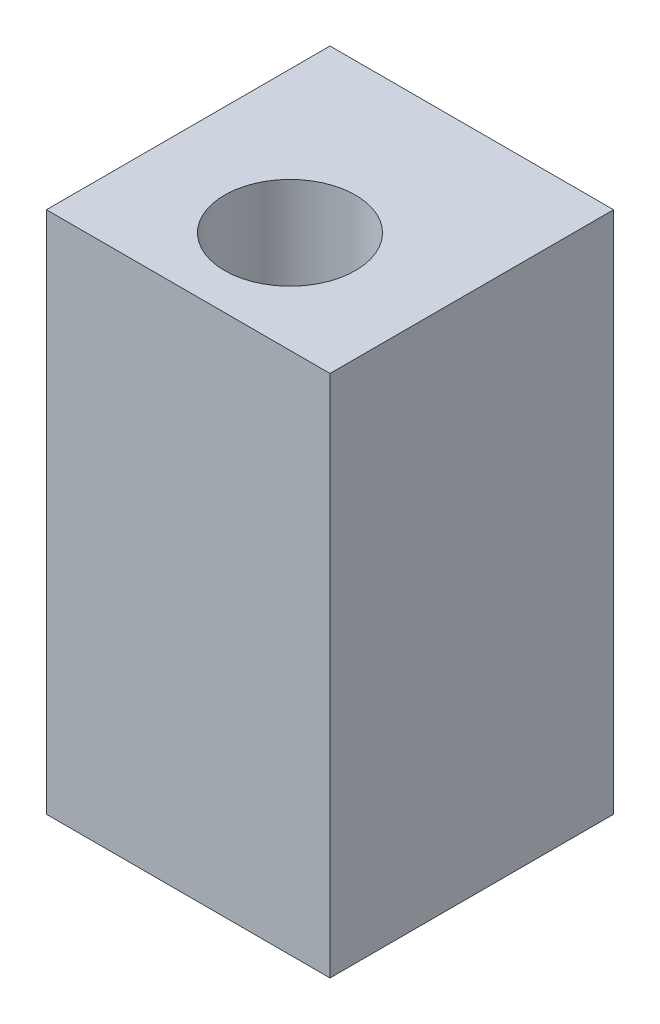
ISO-10303-21;
HEADER;
FILE_DESCRIPTION(('STEP AP214'),'2;1');
FILE_NAME('part.step','',(''),(''),'','','');
FILE_SCHEMA(('AUTOMOTIVE_DESIGN { 1 0 10303 214 1 1 1 1 }'));
ENDSEC;
DATA;
#1=APPLICATION_CONTEXT('core data for automotive mechanical design processes');
#2=APPLICATION_PROTOCOL_DEFINITION('international standard','automotive_design',2000,#1);
#3=PRODUCT_CONTEXT('',#1,'mechanical');
#4=PRODUCT('Part','Part','',(#3));
#5=PRODUCT_RELATED_PRODUCT_CATEGORY('part','',(#4));
#6=PRODUCT_DEFINITION_FORMATION('','',#4);
#7=PRODUCT_DEFINITION_CONTEXT('part definition',#1,'design');
#8=PRODUCT_DEFINITION('design','',#6,#7);
#9=PRODUCT_DEFINITION_SHAPE('','',#8);
#10=(LENGTH_UNIT() NAMED_UNIT(*) SI_UNIT(.MILLI.,.METRE.));
#11=(NAMED_UNIT(*) PLANE_ANGLE_UNIT() SI_UNIT($,.RADIAN.));
#12=(NAMED_UNIT(*) SI_UNIT($,.STERADIAN.) SOLID_ANGLE_UNIT());
#13=UNCERTAINTY_MEASURE_WITH_UNIT(LENGTH_MEASURE(1.E-05),#10,'distance_accuracy_value','');
#14=(GEOMETRIC_REPRESENTATION_CONTEXT(3) GLOBAL_UNCERTAINTY_ASSIGNED_CONTEXT((#13)) GLOBAL_UNIT_ASSIGNED_CONTEXT((#10,
#11,#12)) REPRESENTATION_CONTEXT('',''));
#15=CARTESIAN_POINT('',(0.,0.,0.));
#16=DIRECTION('',(0.,0.,1.));
#17=DIRECTION('',(1.,0.,0.));
#18=AXIS2_PLACEMENT_3D('',#15,#16,#17);
#19=CARTESIAN_POINT('',(4.875,18.,-4.875));
#20=DIRECTION('',(-1.,0.,0.));
#21=DIRECTION('',(0.,0.,1.));
#22=AXIS2_PLACEMENT_3D('',#19,#20,#21);
#23=PLANE('',#22);
#24=DIRECTION('',(0.,0.,-1.));
#25=VECTOR('',#24,1.);
#26=CARTESIAN_POINT('',(4.875,0.,-4.875));
#27=LINE('',#26,#25);
#28=CARTESIAN_POINT('',(4.875,0.,4.875));
#29=VERTEX_POINT('',#28);
#30=CARTESIAN_POINT('',(4.875,0.,-4.875));
#31=VERTEX_POINT('',#30);
#32=EDGE_CURVE('E102',#29,#31,#27,.T.);
#33=ORIENTED_EDGE('',*,*,#32,.T.);
#34=DIRECTION('',(0.,-1.,0.));
#35=VECTOR('',#34,1.);
#36=CARTESIAN_POINT('',(4.875,18.,-4.875));
#37=LINE('',#36,#35);
#38=CARTESIAN_POINT('',(4.875,18.,-4.875));
#39=VERTEX_POINT('',#38);
#40=EDGE_CURVE('E11',#39,#31,#37,.T.);
#41=ORIENTED_EDGE('',*,*,#40,.F.);
#42=DIRECTION('',(0.,0.,-1.));
#43=VECTOR('',#42,1.);
#44=CARTESIAN_POINT('',(4.875,18.,-4.875));
#45=LINE('',#44,#43);
#46=CARTESIAN_POINT('',(4.875,18.,4.875));
#47=VERTEX_POINT('',#46);
#48=EDGE_CURVE('E89',#47,#39,#45,.T.);
#49=ORIENTED_EDGE('',*,*,#48,.F.);
#50=DIRECTION('',(0.,-1.,0.));
#51=VECTOR('',#50,1.);
#52=CARTESIAN_POINT('',(4.875,18.,4.875));
#53=LINE('',#52,#51);
#54=EDGE_CURVE('E98',#47,#29,#53,.T.);
#55=ORIENTED_EDGE('',*,*,#54,.T.);
#56=EDGE_LOOP('',(#33,#41,#49,#55));
#57=FACE_BOUND('',#56,.T.);
#58=ADVANCED_FACE('F37',(#57),#23,.F.);
#59=CARTESIAN_POINT('',(-4.875,18.,-4.875));
#60=DIRECTION('',(0.,0.,1.));
#61=DIRECTION('',(1.,0.,0.));
#62=AXIS2_PLACEMENT_3D('',#59,#60,#61);
#63=PLANE('',#62);
#64=DIRECTION('',(-1.,0.,0.));
#65=VECTOR('',#64,1.);
#66=CARTESIAN_POINT('',(-4.875,0.,-4.875));
#67=LINE('',#66,#65);
#68=CARTESIAN_POINT('',(-4.875,0.,-4.875));
#69=VERTEX_POINT('',#68);
#70=EDGE_CURVE('E93',#31,#69,#67,.T.);
#71=ORIENTED_EDGE('',*,*,#70,.T.);
#72=DIRECTION('',(0.,-1.,0.));
#73=VECTOR('',#72,1.);
#74=CARTESIAN_POINT('',(-4.875,18.,-4.875));
#75=LINE('',#74,#73);
#76=CARTESIAN_POINT('',(-4.875,18.,-4.875));
#77=VERTEX_POINT('',#76);
#78=EDGE_CURVE('E46',#77,#69,#75,.T.);
#79=ORIENTED_EDGE('',*,*,#78,.F.);
#80=DIRECTION('',(-1.,0.,0.));
#81=VECTOR('',#80,1.);
#82=CARTESIAN_POINT('',(-4.875,18.,-4.875));
#83=LINE('',#82,#81);
#84=EDGE_CURVE('E84',#39,#77,#83,.T.);
#85=ORIENTED_EDGE('',*,*,#84,.F.);
#86=ORIENTED_EDGE('',*,*,#40,.T.);
#87=EDGE_LOOP('',(#71,#79,#85,#86));
#88=FACE_BOUND('',#87,.T.);
#89=ADVANCED_FACE('F92',(#88),#63,.F.);
#90=CARTESIAN_POINT('',(-4.875,18.,-4.875));
#91=DIRECTION('',(1.,0.,0.));
#92=DIRECTION('',(0.,0.,-1.));
#93=AXIS2_PLACEMENT_3D('',#90,#91,#92);
#94=PLANE('',#93);
#95=DIRECTION('',(0.,0.,1.));
#96=VECTOR('',#95,1.);
#97=CARTESIAN_POINT('',(-4.875,0.,-4.875));
#98=LINE('',#97,#96);
#99=CARTESIAN_POINT('',(-4.875,0.,4.875));
#100=VERTEX_POINT('',#99);
#101=EDGE_CURVE('E71',#69,#100,#98,.T.);
#102=ORIENTED_EDGE('',*,*,#101,.T.);
#103=DIRECTION('',(0.,-1.,0.));
#104=VECTOR('',#103,1.);
#105=CARTESIAN_POINT('',(-4.875,18.,4.875));
#106=LINE('',#105,#104);
#107=CARTESIAN_POINT('',(-4.875,18.,4.875));
#108=VERTEX_POINT('',#107);
#109=EDGE_CURVE('E94',#108,#100,#106,.T.);
#110=ORIENTED_EDGE('',*,*,#109,.F.);
#111=DIRECTION('',(0.,0.,1.));
#112=VECTOR('',#111,1.);
#113=CARTESIAN_POINT('',(-4.875,18.,-4.875));
#114=LINE('',#113,#112);
#115=EDGE_CURVE('E87',#77,#108,#114,.T.);
#116=ORIENTED_EDGE('',*,*,#115,.F.);
#117=ORIENTED_EDGE('',*,*,#78,.T.);
#118=EDGE_LOOP('',(#102,#110,#116,#117));
#119=FACE_BOUND('',#118,.T.);
#120=ADVANCED_FACE('F96',(#119),#94,.F.);
#121=CARTESIAN_POINT('',(-4.875,18.,4.875));
#122=DIRECTION('',(0.,0.,-1.));
#123=DIRECTION('',(-1.,0.,0.));
#124=AXIS2_PLACEMENT_3D('',#121,#122,#123);
#125=PLANE('',#124);
#126=DIRECTION('',(1.,0.,0.));
#127=VECTOR('',#126,1.);
#128=CARTESIAN_POINT('',(-4.875,0.,4.875));
#129=LINE('',#128,#127);
#130=EDGE_CURVE('E77',#100,#29,#129,.T.);
#131=ORIENTED_EDGE('',*,*,#130,.T.);
#132=ORIENTED_EDGE('',*,*,#54,.F.);
#133=DIRECTION('',(1.,0.,0.));
#134=VECTOR('',#133,1.);
#135=CARTESIAN_POINT('',(-4.875,18.,4.875));
#136=LINE('',#135,#134);
#137=EDGE_CURVE('E54',#108,#47,#136,.T.);
#138=ORIENTED_EDGE('',*,*,#137,.F.);
#139=ORIENTED_EDGE('',*,*,#109,.T.);
#140=EDGE_LOOP('',(#131,#132,#138,#139));
#141=FACE_BOUND('',#140,.T.);
#142=ADVANCED_FACE('F109',(#141),#125,.F.);
#143=CARTESIAN_POINT('',(0.,18.,0.));
#144=DIRECTION('',(0.,1.,0.));
#145=DIRECTION('',(0.,0.,1.));
#146=AXIS2_PLACEMENT_3D('',#143,#144,#145);
#147=PLANE('',#146);
#148=CARTESIAN_POINT('',(0.,18.,1.375));
#149=DIRECTION('',(0.,1.,0.));
#150=DIRECTION('',(0.,0.,1.));
#151=AXIS2_PLACEMENT_3D('',#148,#149,#150);
#152=CIRCLE('',#151,2.25);
#153=CARTESIAN_POINT('',(0.,18.,3.625));
#154=VERTEX_POINT('',#153);
#155=EDGE_CURVE('E115',#154,#154,#152,.T.);
#156=ORIENTED_EDGE('',*,*,#155,.F.);
#157=EDGE_LOOP('',(#156));
#158=FACE_BOUND('',#157,.T.);
#159=ORIENTED_EDGE('',*,*,#48,.T.);
#160=ORIENTED_EDGE('',*,*,#84,.T.);
#161=ORIENTED_EDGE('',*,*,#115,.T.);
#162=ORIENTED_EDGE('',*,*,#137,.T.);
#163=EDGE_LOOP('',(#159,#160,#161,#162));
#164=FACE_BOUND('',#163,.T.);
#165=ADVANCED_FACE('F85',(#158,#164),#147,.T.);
#166=CARTESIAN_POINT('',(0.,0.,0.));
#167=DIRECTION('',(0.,1.,0.));
#168=DIRECTION('',(0.,0.,1.));
#169=AXIS2_PLACEMENT_3D('',#166,#167,#168);
#170=PLANE('',#169);
#171=CARTESIAN_POINT('',(0.,0.,1.375));
#172=DIRECTION('',(0.,1.,0.));
#173=DIRECTION('',(0.,0.,1.));
#174=AXIS2_PLACEMENT_3D('',#171,#172,#173);
#175=CIRCLE('',#174,2.25);
#176=CARTESIAN_POINT('',(0.,0.,3.625));
#177=VERTEX_POINT('',#176);
#178=EDGE_CURVE('E40',#177,#177,#175,.T.);
#179=ORIENTED_EDGE('',*,*,#178,.T.);
#180=EDGE_LOOP('',(#179));
#181=FACE_BOUND('',#180,.T.);
#182=ORIENTED_EDGE('',*,*,#32,.F.);
#183=ORIENTED_EDGE('',*,*,#130,.F.);
#184=ORIENTED_EDGE('',*,*,#101,.F.);
#185=ORIENTED_EDGE('',*,*,#70,.F.);
#186=EDGE_LOOP('',(#182,#183,#184,#185));
#187=FACE_BOUND('',#186,.T.);
#188=ADVANCED_FACE('F112',(#181,#187),#170,.F.);
#189=CARTESIAN_POINT('',(0.,-3.00000000000001,1.375));
#190=DIRECTION('',(0.,1.,0.));
#191=DIRECTION('',(0.,0.,1.));
#192=AXIS2_PLACEMENT_3D('',#189,#190,#191);
#193=CYLINDRICAL_SURFACE('',#192,2.25);
#194=ORIENTED_EDGE('',*,*,#155,.T.);
#195=EDGE_LOOP('',(#194));
#196=FACE_BOUND('',#195,.T.);
#197=ORIENTED_EDGE('',*,*,#178,.F.);
#198=EDGE_LOOP('',(#197));
#199=FACE_BOUND('',#198,.T.);
#200=ADVANCED_FACE('F123',(#196,#199),#193,.F.);
#201=CLOSED_SHELL('',(#58,#89,#120,#142,#165,#188,#200));
#202=MANIFOLD_SOLID_BREP('B2',#201);
#203=ADVANCED_BREP_SHAPE_REPRESENTATION('',(#18,#202),#14);
#204=SHAPE_DEFINITION_REPRESENTATION(#9,#203);
ENDSEC;
END-ISO-10303-21;
